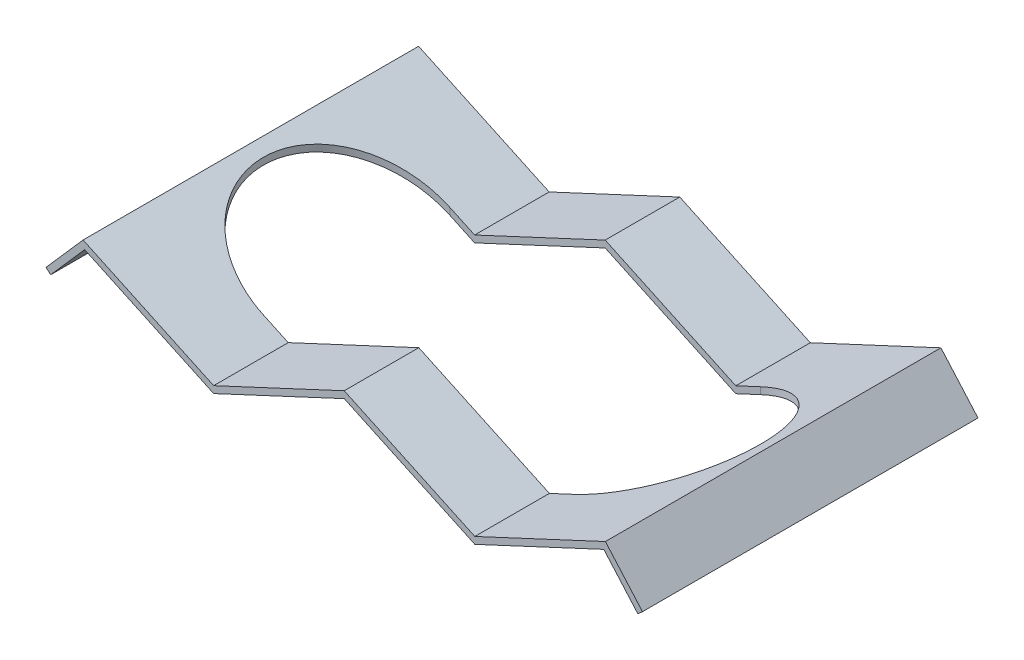
ISO-10303-21;
HEADER;
FILE_DESCRIPTION(('STEP AP214'),'2;1');
FILE_NAME('part.step','',(''),(''),'','','');
FILE_SCHEMA(('AUTOMOTIVE_DESIGN { 1 0 10303 214 1 1 1 1 }'));
ENDSEC;
DATA;
#1=APPLICATION_CONTEXT('core data for automotive mechanical design processes');
#2=APPLICATION_PROTOCOL_DEFINITION('international standard','automotive_design',2000,#1);
#3=PRODUCT_CONTEXT('',#1,'mechanical');
#4=PRODUCT('Part','Part','',(#3));
#5=PRODUCT_RELATED_PRODUCT_CATEGORY('part','',(#4));
#6=PRODUCT_DEFINITION_FORMATION('','',#4);
#7=PRODUCT_DEFINITION_CONTEXT('part definition',#1,'design');
#8=PRODUCT_DEFINITION('design','',#6,#7);
#9=PRODUCT_DEFINITION_SHAPE('','',#8);
#10=(LENGTH_UNIT() NAMED_UNIT(*) SI_UNIT(.MILLI.,.METRE.));
#11=(NAMED_UNIT(*) PLANE_ANGLE_UNIT() SI_UNIT($,.RADIAN.));
#12=(NAMED_UNIT(*) SI_UNIT($,.STERADIAN.) SOLID_ANGLE_UNIT());
#13=UNCERTAINTY_MEASURE_WITH_UNIT(LENGTH_MEASURE(1.E-05),#10,'distance_accuracy_value','');
#14=(GEOMETRIC_REPRESENTATION_CONTEXT(3) GLOBAL_UNCERTAINTY_ASSIGNED_CONTEXT((#13)) GLOBAL_UNIT_ASSIGNED_CONTEXT((#10,
#11,#12)) REPRESENTATION_CONTEXT('',''));
#15=CARTESIAN_POINT('',(0.,0.,0.));
#16=DIRECTION('',(0.,0.,1.));
#17=DIRECTION('',(1.,0.,0.));
#18=AXIS2_PLACEMENT_3D('',#15,#16,#17);
#19=CARTESIAN_POINT('',(0.,2.45,13.5));
#20=DIRECTION('',(0.422618261740701,0.906307787036649,0.));
#21=DIRECTION('',(-0.906307787036649,0.422618261740701,0.));
#22=AXIS2_PLACEMENT_3D('',#19,#20,#21);
#23=PLANE('',#22);
#24=DIRECTION('',(-0.906307787036649,0.422618261740701,0.));
#25=VECTOR('',#24,1.);
#26=CARTESIAN_POINT('',(0.,2.45,-7.5));
#27=LINE('',#26,#25);
#28=CARTESIAN_POINT('',(10.5080839104968,-2.45,-7.5));
#29=VERTEX_POINT('',#28);
#30=CARTESIAN_POINT('',(0.,2.45000000000001,-7.5));
#31=VERTEX_POINT('',#30);
#32=EDGE_CURVE('E411',#29,#31,#27,.T.);
#33=ORIENTED_EDGE('',*,*,#32,.F.);
#34=DIRECTION('',(0.,0.,-1.));
#35=VECTOR('',#34,1.);
#36=CARTESIAN_POINT('',(10.5080839104968,-2.45,13.5));
#37=LINE('',#36,#35);
#38=CARTESIAN_POINT('',(10.5080839104968,-2.45,-13.5));
#39=VERTEX_POINT('',#38);
#40=EDGE_CURVE('E273',#29,#39,#37,.T.);
#41=ORIENTED_EDGE('',*,*,#40,.T.);
#42=DIRECTION('',(0.906307787036649,-0.422618261740701,0.));
#43=VECTOR('',#42,1.);
#44=CARTESIAN_POINT('',(0.,2.45,-13.5));
#45=LINE('',#44,#43);
#46=CARTESIAN_POINT('',(0.,2.45,-13.5));
#47=VERTEX_POINT('',#46);
#48=EDGE_CURVE('E337',#47,#39,#45,.T.);
#49=ORIENTED_EDGE('',*,*,#48,.F.);
#50=DIRECTION('',(0.,0.,-1.));
#51=VECTOR('',#50,1.);
#52=CARTESIAN_POINT('',(0.,2.45,13.5));
#53=LINE('',#52,#51);
#54=EDGE_CURVE('E268',#31,#47,#53,.T.);
#55=ORIENTED_EDGE('',*,*,#54,.F.);
#56=EDGE_LOOP('',(#33,#41,#49,#55));
#57=FACE_BOUND('',#56,.T.);
#58=ADVANCED_FACE('F43',(#57),#23,.T.);
#59=CARTESIAN_POINT('',(-10.5080839104968,-2.45,13.5));
#60=DIRECTION('',(-0.422618261740701,0.906307787036649,0.));
#61=DIRECTION('',(-0.906307787036649,-0.422618261740701,0.));
#62=AXIS2_PLACEMENT_3D('',#59,#60,#61);
#63=PLANE('',#62);
#64=DIRECTION('',(-0.906307787036649,-0.422618261740701,0.));
#65=VECTOR('',#64,1.);
#66=CARTESIAN_POINT('',(-10.5080839104968,-2.45,-7.5));
#67=LINE('',#66,#65);
#68=CARTESIAN_POINT('',(-10.5080839104968,-2.45,-7.5));
#69=VERTEX_POINT('',#68);
#70=EDGE_CURVE('E414',#31,#69,#67,.T.);
#71=ORIENTED_EDGE('',*,*,#70,.F.);
#72=ORIENTED_EDGE('',*,*,#54,.T.);
#73=DIRECTION('',(0.906307787036649,0.422618261740701,0.));
#74=VECTOR('',#73,1.);
#75=CARTESIAN_POINT('',(-10.5080839104968,-2.45,-13.5));
#76=LINE('',#75,#74);
#77=CARTESIAN_POINT('',(-10.5080839104968,-2.45,-13.5));
#78=VERTEX_POINT('',#77);
#79=EDGE_CURVE('E333',#78,#47,#76,.T.);
#80=ORIENTED_EDGE('',*,*,#79,.F.);
#81=DIRECTION('',(0.,0.,-1.));
#82=VECTOR('',#81,1.);
#83=CARTESIAN_POINT('',(-10.5080839104968,-2.45,13.5));
#84=LINE('',#83,#82);
#85=EDGE_CURVE('E263',#69,#78,#84,.T.);
#86=ORIENTED_EDGE('',*,*,#85,.F.);
#87=EDGE_LOOP('',(#71,#72,#80,#86));
#88=FACE_BOUND('',#87,.T.);
#89=ADVANCED_FACE('F524',(#88),#63,.T.);
#90=CARTESIAN_POINT('',(-10.2967747796265,-2.90315389351832,13.5));
#91=DIRECTION('',(-0.422618261740701,0.906307787036649,0.));
#92=DIRECTION('',(-0.906307787036649,-0.422618261740701,0.));
#93=AXIS2_PLACEMENT_3D('',#90,#91,#92);
#94=PLANE('',#93);
#95=DIRECTION('',(0.,0.,-1.));
#96=VECTOR('',#95,1.);
#97=CARTESIAN_POINT('',(0.,1.89831104051876,13.5));
#98=LINE('',#97,#96);
#99=CARTESIAN_POINT('',(0.,1.89831104051876,-7.5));
#100=VERTEX_POINT('',#99);
#101=CARTESIAN_POINT('',(0.,1.89831104051876,-13.5));
#102=VERTEX_POINT('',#101);
#103=EDGE_CURVE('E235',#100,#102,#98,.T.);
#104=ORIENTED_EDGE('',*,*,#103,.F.);
#105=DIRECTION('',(-0.906307787036649,-0.422618261740701,0.));
#106=VECTOR('',#105,1.);
#107=CARTESIAN_POINT('',(-10.2967747796265,-2.90315389351832,-7.5));
#108=LINE('',#107,#106);
#109=CARTESIAN_POINT('',(-10.5080839104968,-3.00168895948125,-7.5));
#110=VERTEX_POINT('',#109);
#111=EDGE_CURVE('E209',#100,#110,#108,.T.);
#112=ORIENTED_EDGE('',*,*,#111,.T.);
#113=DIRECTION('',(0.,0.,-1.));
#114=VECTOR('',#113,1.);
#115=CARTESIAN_POINT('',(-10.5080839104968,-3.00168895948124,13.5));
#116=LINE('',#115,#114);
#117=CARTESIAN_POINT('',(-10.5080839104968,-3.00168895948124,-13.5));
#118=VERTEX_POINT('',#117);
#119=EDGE_CURVE('E245',#110,#118,#116,.T.);
#120=ORIENTED_EDGE('',*,*,#119,.T.);
#121=DIRECTION('',(0.906307787036649,0.422618261740701,0.));
#122=VECTOR('',#121,1.);
#123=CARTESIAN_POINT('',(-10.2967747796265,-2.90315389351832,-13.5));
#124=LINE('',#123,#122);
#125=EDGE_CURVE('E299',#118,#102,#124,.T.);
#126=ORIENTED_EDGE('',*,*,#125,.T.);
#127=EDGE_LOOP('',(#104,#112,#120,#126));
#128=FACE_BOUND('',#127,.T.);
#129=ADVANCED_FACE('F300',(#128),#94,.F.);
#130=CARTESIAN_POINT('',(-0.211309130870354,1.99684610648168,13.5));
#131=DIRECTION('',(0.422618261740701,0.906307787036649,0.));
#132=DIRECTION('',(-0.906307787036649,0.422618261740701,0.));
#133=AXIS2_PLACEMENT_3D('',#130,#131,#132);
#134=PLANE('',#133);
#135=DIRECTION('',(0.,0.,-1.));
#136=VECTOR('',#135,1.);
#137=CARTESIAN_POINT('',(10.5080839104968,-3.00168895948125,13.5));
#138=LINE('',#137,#136);
#139=CARTESIAN_POINT('',(10.5080839104968,-3.00168895948125,-7.5));
#140=VERTEX_POINT('',#139);
#141=CARTESIAN_POINT('',(10.5080839104968,-3.00168895948125,-13.5));
#142=VERTEX_POINT('',#141);
#143=EDGE_CURVE('E219',#140,#142,#138,.T.);
#144=ORIENTED_EDGE('',*,*,#143,.F.);
#145=DIRECTION('',(-0.906307787036649,0.422618261740701,0.));
#146=VECTOR('',#145,1.);
#147=CARTESIAN_POINT('',(-0.211309130870354,1.99684610648168,-7.5));
#148=LINE('',#147,#146);
#149=EDGE_CURVE('E203',#140,#100,#148,.T.);
#150=ORIENTED_EDGE('',*,*,#149,.T.);
#151=ORIENTED_EDGE('',*,*,#103,.T.);
#152=DIRECTION('',(0.906307787036649,-0.422618261740701,0.));
#153=VECTOR('',#152,1.);
#154=CARTESIAN_POINT('',(-0.211309130870354,1.99684610648168,-13.5));
#155=LINE('',#154,#153);
#156=EDGE_CURVE('E226',#102,#142,#155,.T.);
#157=ORIENTED_EDGE('',*,*,#156,.T.);
#158=EDGE_LOOP('',(#144,#150,#151,#157));
#159=FACE_BOUND('',#158,.T.);
#160=ADVANCED_FACE('F224',(#159),#134,.F.);
#161=CARTESIAN_POINT('',(20.6403636734295,2.12019514455722,13.5));
#162=DIRECTION('',(0.751608295128168,0.659609710885558,0.));
#163=DIRECTION('',(-0.659609710885558,0.751608295128168,0.));
#164=AXIS2_PLACEMENT_3D('',#161,#162,#163);
#165=PLANE('',#164);
#166=DIRECTION('',(0.659609710885558,-0.751608295128168,0.));
#167=VECTOR('',#166,1.);
#168=CARTESIAN_POINT('',(20.6403636734295,2.12019514455722,-13.5));
#169=LINE('',#168,#167);
#170=CARTESIAN_POINT('',(20.8876727560338,1.83839280769289,-13.5));
#171=VERTEX_POINT('',#170);
#172=CARTESIAN_POINT('',(23.624195852435,-1.27980485544275,-13.5));
#173=VERTEX_POINT('',#172);
#174=EDGE_CURVE('E353',#171,#173,#169,.T.);
#175=ORIENTED_EDGE('',*,*,#174,.T.);
#176=DIRECTION('',(0.,0.,-1.));
#177=VECTOR('',#176,1.);
#178=CARTESIAN_POINT('',(23.624195852435,-1.27980485544275,13.5));
#179=LINE('',#178,#177);
#180=CARTESIAN_POINT('',(23.624195852435,-1.27980485544275,13.5));
#181=VERTEX_POINT('',#180);
#182=EDGE_CURVE('E284',#181,#173,#179,.T.);
#183=ORIENTED_EDGE('',*,*,#182,.F.);
#184=DIRECTION('',(0.659609710885558,-0.751608295128168,0.));
#185=VECTOR('',#184,1.);
#186=CARTESIAN_POINT('',(20.6403636734295,2.12019514455722,13.5));
#187=LINE('',#186,#185);
#188=CARTESIAN_POINT('',(20.8876727560338,1.83839280769289,13.5));
#189=VERTEX_POINT('',#188);
#190=EDGE_CURVE('E314',#189,#181,#187,.T.);
#191=ORIENTED_EDGE('',*,*,#190,.F.);
#192=DIRECTION('',(0.,0.,-1.));
#193=VECTOR('',#192,1.);
#194=CARTESIAN_POINT('',(20.8876727560338,1.83839280769289,13.5));
#195=LINE('',#194,#193);
#196=EDGE_CURVE('E230',#189,#171,#195,.T.);
#197=ORIENTED_EDGE('',*,*,#196,.T.);
#198=EDGE_LOOP('',(#175,#183,#191,#197));
#199=FACE_BOUND('',#198,.T.);
#200=ADVANCED_FACE('F45',(#199),#165,.F.);
#201=CARTESIAN_POINT('',(23.9999999999991,-0.949999999999971,13.5));
#202=DIRECTION('',(0.659609710885559,-0.751608295128167,0.));
#203=DIRECTION('',(0.751608295128167,0.659609710885559,0.));
#204=AXIS2_PLACEMENT_3D('',#201,#202,#203);
#205=PLANE('',#204);
#206=DIRECTION('',(-0.751608295128167,-0.659609710885559,0.));
#207=VECTOR('',#206,1.);
#208=CARTESIAN_POINT('',(23.9999999999991,-0.949999999999971,-13.5));
#209=LINE('',#208,#207);
#210=CARTESIAN_POINT('',(23.9999999999991,-0.949999999999971,-13.5));
#211=VERTEX_POINT('',#210);
#212=EDGE_CURVE('E349',#211,#173,#209,.T.);
#213=ORIENTED_EDGE('',*,*,#212,.F.);
#214=DIRECTION('',(0.,0.,-1.));
#215=VECTOR('',#214,1.);
#216=CARTESIAN_POINT('',(23.9999999999991,-0.949999999999971,13.5));
#217=LINE('',#216,#215);
#218=CARTESIAN_POINT('',(23.9999999999991,-0.949999999999971,13.5));
#219=VERTEX_POINT('',#218);
#220=EDGE_CURVE('E281',#219,#211,#217,.T.);
#221=ORIENTED_EDGE('',*,*,#220,.F.);
#222=DIRECTION('',(-0.751608295128167,-0.659609710885559,0.));
#223=VECTOR('',#222,1.);
#224=CARTESIAN_POINT('',(23.9999999999991,-0.949999999999971,13.5));
#225=LINE('',#224,#223);
#226=EDGE_CURVE('E400',#219,#181,#225,.T.);
#227=ORIENTED_EDGE('',*,*,#226,.T.);
#228=ORIENTED_EDGE('',*,*,#182,.T.);
#229=EDGE_LOOP('',(#213,#221,#227,#228));
#230=FACE_BOUND('',#229,.T.);
#231=ADVANCED_FACE('F534',(#230),#205,.T.);
#232=CARTESIAN_POINT('',(21.0161678209936,2.45,13.5));
#233=DIRECTION('',(0.751608295128168,0.659609710885558,0.));
#234=DIRECTION('',(-0.659609710885558,0.751608295128168,0.));
#235=AXIS2_PLACEMENT_3D('',#232,#233,#234);
#236=PLANE('',#235);
#237=DIRECTION('',(0.659609710885558,-0.751608295128168,0.));
#238=VECTOR('',#237,1.);
#239=CARTESIAN_POINT('',(21.0161678209936,2.45,-13.5));
#240=LINE('',#239,#238);
#241=CARTESIAN_POINT('',(21.0161678209936,2.45,-13.5));
#242=VERTEX_POINT('',#241);
#243=EDGE_CURVE('E345',#242,#211,#240,.T.);
#244=ORIENTED_EDGE('',*,*,#243,.F.);
#245=DIRECTION('',(0.,0.,-1.));
#246=VECTOR('',#245,1.);
#247=CARTESIAN_POINT('',(21.0161678209936,2.45,13.5));
#248=LINE('',#247,#246);
#249=CARTESIAN_POINT('',(21.0161678209936,2.45,13.5));
#250=VERTEX_POINT('',#249);
#251=EDGE_CURVE('E278',#250,#242,#248,.T.);
#252=ORIENTED_EDGE('',*,*,#251,.F.);
#253=DIRECTION('',(0.659609710885558,-0.751608295128168,0.));
#254=VECTOR('',#253,1.);
#255=CARTESIAN_POINT('',(21.0161678209936,2.45,13.5));
#256=LINE('',#255,#254);
#257=EDGE_CURVE('E396',#250,#219,#256,.T.);
#258=ORIENTED_EDGE('',*,*,#257,.T.);
#259=ORIENTED_EDGE('',*,*,#220,.T.);
#260=EDGE_LOOP('',(#244,#252,#258,#259));
#261=FACE_BOUND('',#260,.T.);
#262=ADVANCED_FACE('F532',(#261),#236,.T.);
#263=CARTESIAN_POINT('',(10.5080839104968,-2.45,13.5));
#264=DIRECTION('',(-0.4226182617407,0.906307787036649,0.));
#265=DIRECTION('',(-0.906307787036649,-0.4226182617407,0.));
#266=AXIS2_PLACEMENT_3D('',#263,#264,#265);
#267=PLANE('',#266);
#268=DIRECTION('',(-0.906307787036649,-0.4226182617407,0.));
#269=VECTOR('',#268,1.);
#270=CARTESIAN_POINT('',(10.5080839104968,-2.45,-7.5));
#271=LINE('',#270,#269);
#272=CARTESIAN_POINT('',(12.5,-1.52115427306249,-7.5));
#273=VERTEX_POINT('',#272);
#274=EDGE_CURVE('E408',#273,#29,#271,.T.);
#275=ORIENTED_EDGE('',*,*,#274,.F.);
#276=CARTESIAN_POINT('',(12.5,-1.52115427306249,0.));
#277=DIRECTION('',(-0.4226182617407,0.906307787036649,0.));
#278=DIRECTION('',(0.906307787036649,0.4226182617407,0.));
#279=AXIS2_PLACEMENT_3D('',#276,#277,#278);
#280=ELLIPSE('',#279,8.27533439221869,7.5);
#281=CARTESIAN_POINT('',(12.5,-1.52115427306249,7.5));
#282=VERTEX_POINT('',#281);
#283=EDGE_CURVE('E214',#282,#273,#280,.T.);
#284=ORIENTED_EDGE('',*,*,#283,.F.);
#285=DIRECTION('',(0.906307787036649,0.4226182617407,0.));
#286=VECTOR('',#285,1.);
#287=CARTESIAN_POINT('',(10.5080839104968,-2.45,7.5));
#288=LINE('',#287,#286);
#289=CARTESIAN_POINT('',(10.5080839104968,-2.45,7.5));
#290=VERTEX_POINT('',#289);
#291=EDGE_CURVE('E428',#290,#282,#288,.T.);
#292=ORIENTED_EDGE('',*,*,#291,.F.);
#293=CARTESIAN_POINT('',(10.5080839104968,-2.45,13.5));
#294=VERTEX_POINT('',#293);
#295=EDGE_CURVE('E274',#294,#290,#37,.T.);
#296=ORIENTED_EDGE('',*,*,#295,.F.);
#297=DIRECTION('',(0.906307787036649,0.4226182617407,0.));
#298=VECTOR('',#297,1.);
#299=CARTESIAN_POINT('',(10.5080839104968,-2.45,13.5));
#300=LINE('',#299,#298);
#301=EDGE_CURVE('E392',#294,#250,#300,.T.);
#302=ORIENTED_EDGE('',*,*,#301,.T.);
#303=ORIENTED_EDGE('',*,*,#251,.T.);
#304=DIRECTION('',(0.906307787036649,0.4226182617407,0.));
#305=VECTOR('',#304,1.);
#306=CARTESIAN_POINT('',(10.5080839104968,-2.45,-13.5));
#307=LINE('',#306,#305);
#308=EDGE_CURVE('E341',#39,#242,#307,.T.);
#309=ORIENTED_EDGE('',*,*,#308,.F.);
#310=ORIENTED_EDGE('',*,*,#40,.F.);
#311=EDGE_LOOP('',(#275,#284,#292,#296,#302,#303,#309,#310));
#312=FACE_BOUND('',#311,.T.);
#313=ADVANCED_FACE('F488',(#312),#267,.T.);
#314=DIRECTION('',(0.906307787036649,-0.422618261740701,0.));
#315=VECTOR('',#314,1.);
#316=CARTESIAN_POINT('',(0.,2.45,7.5));
#317=LINE('',#316,#315);
#318=CARTESIAN_POINT('',(0.,2.45000000000001,7.5));
#319=VERTEX_POINT('',#318);
#320=EDGE_CURVE('E431',#319,#290,#317,.T.);
#321=ORIENTED_EDGE('',*,*,#320,.F.);
#322=CARTESIAN_POINT('',(0.,2.45,13.5));
#323=VERTEX_POINT('',#322);
#324=EDGE_CURVE('E269',#323,#319,#53,.T.);
#325=ORIENTED_EDGE('',*,*,#324,.F.);
#326=DIRECTION('',(0.906307787036649,-0.422618261740701,0.));
#327=VECTOR('',#326,1.);
#328=CARTESIAN_POINT('',(0.,2.45,13.5));
#329=LINE('',#328,#327);
#330=EDGE_CURVE('E388',#323,#294,#329,.T.);
#331=ORIENTED_EDGE('',*,*,#330,.T.);
#332=ORIENTED_EDGE('',*,*,#295,.T.);
#333=EDGE_LOOP('',(#321,#325,#331,#332));
#334=FACE_BOUND('',#333,.T.);
#335=ADVANCED_FACE('F479',(#334),#23,.T.);
#336=DIRECTION('',(0.906307787036649,0.422618261740701,0.));
#337=VECTOR('',#336,1.);
#338=CARTESIAN_POINT('',(-10.5080839104968,-2.45,7.5));
#339=LINE('',#338,#337);
#340=CARTESIAN_POINT('',(-10.5080839104968,-2.45,7.5));
#341=VERTEX_POINT('',#340);
#342=EDGE_CURVE('E434',#341,#319,#339,.T.);
#343=ORIENTED_EDGE('',*,*,#342,.F.);
#344=CARTESIAN_POINT('',(-10.5080839104968,-2.45,13.5));
#345=VERTEX_POINT('',#344);
#346=EDGE_CURVE('E264',#345,#341,#84,.T.);
#347=ORIENTED_EDGE('',*,*,#346,.F.);
#348=DIRECTION('',(0.906307787036649,0.422618261740701,0.));
#349=VECTOR('',#348,1.);
#350=CARTESIAN_POINT('',(-10.5080839104968,-2.45,13.5));
#351=LINE('',#350,#349);
#352=EDGE_CURVE('E384',#345,#323,#351,.T.);
#353=ORIENTED_EDGE('',*,*,#352,.T.);
#354=ORIENTED_EDGE('',*,*,#324,.T.);
#355=EDGE_LOOP('',(#343,#347,#353,#354));
#356=FACE_BOUND('',#355,.T.);
#357=ADVANCED_FACE('F475',(#356),#63,.T.);
#358=CARTESIAN_POINT('',(-21.0161678209936,2.45000000000001,13.5));
#359=DIRECTION('',(0.4226182617407,0.906307787036649,0.));
#360=DIRECTION('',(-0.906307787036649,0.4226182617407,0.));
#361=AXIS2_PLACEMENT_3D('',#358,#359,#360);
#362=PLANE('',#361);
#363=DIRECTION('',(-0.906307787036649,0.4226182617407,0.));
#364=VECTOR('',#363,1.);
#365=CARTESIAN_POINT('',(-21.0161678209936,2.45000000000001,-7.5));
#366=LINE('',#365,#364);
#367=CARTESIAN_POINT('',(-12.5,-1.5211542730625,-7.5));
#368=VERTEX_POINT('',#367);
#369=EDGE_CURVE('E417',#69,#368,#366,.T.);
#370=ORIENTED_EDGE('',*,*,#369,.F.);
#371=ORIENTED_EDGE('',*,*,#85,.T.);
#372=DIRECTION('',(0.906307787036649,-0.4226182617407,0.));
#373=VECTOR('',#372,1.);
#374=CARTESIAN_POINT('',(-21.0161678209936,2.45000000000001,-13.5));
#375=LINE('',#374,#373);
#376=CARTESIAN_POINT('',(-21.0161678209936,2.45000000000001,-13.5));
#377=VERTEX_POINT('',#376);
#378=EDGE_CURVE('E329',#377,#78,#375,.T.);
#379=ORIENTED_EDGE('',*,*,#378,.F.);
#380=DIRECTION('',(0.,0.,-1.));
#381=VECTOR('',#380,1.);
#382=CARTESIAN_POINT('',(-21.0161678209936,2.45000000000001,13.5));
#383=LINE('',#382,#381);
#384=CARTESIAN_POINT('',(-21.0161678209936,2.45000000000001,13.5));
#385=VERTEX_POINT('',#384);
#386=EDGE_CURVE('E260',#385,#377,#383,.T.);
#387=ORIENTED_EDGE('',*,*,#386,.F.);
#388=DIRECTION('',(0.906307787036649,-0.4226182617407,0.));
#389=VECTOR('',#388,1.);
#390=CARTESIAN_POINT('',(-21.0161678209936,2.45000000000001,13.5));
#391=LINE('',#390,#389);
#392=EDGE_CURVE('E380',#385,#345,#391,.T.);
#393=ORIENTED_EDGE('',*,*,#392,.T.);
#394=ORIENTED_EDGE('',*,*,#346,.T.);
#395=DIRECTION('',(0.906307787036649,-0.4226182617407,0.));
#396=VECTOR('',#395,1.);
#397=CARTESIAN_POINT('',(-21.0161678209936,2.45000000000001,7.5));
#398=LINE('',#397,#396);
#399=CARTESIAN_POINT('',(-12.5,-1.5211542730625,7.5));
#400=VERTEX_POINT('',#399);
#401=EDGE_CURVE('E437',#400,#341,#398,.T.);
#402=ORIENTED_EDGE('',*,*,#401,.F.);
#403=CARTESIAN_POINT('',(-12.5,-1.5211542730625,0.));
#404=DIRECTION('',(0.4226182617407,0.906307787036649,0.));
#405=DIRECTION('',(-0.90630778703665,0.4226182617407,0.));
#406=AXIS2_PLACEMENT_3D('',#403,#404,#405);
#407=ELLIPSE('',#406,8.27533439221869,7.5);
#408=EDGE_CURVE('E357',#368,#400,#407,.T.);
#409=ORIENTED_EDGE('',*,*,#408,.F.);
#410=EDGE_LOOP('',(#370,#371,#379,#387,#393,#394,#402,#409));
#411=FACE_BOUND('',#410,.T.);
#412=ADVANCED_FACE('F469',(#411),#362,.T.);
#413=CARTESIAN_POINT('',(-23.9999999999991,-0.949999999999917,13.5));
#414=DIRECTION('',(-0.751608295128168,0.659609710885558,0.));
#415=DIRECTION('',(-0.659609710885558,-0.751608295128168,0.));
#416=AXIS2_PLACEMENT_3D('',#413,#414,#415);
#417=PLANE('',#416);
#418=DIRECTION('',(0.659609710885558,0.751608295128167,0.));
#419=VECTOR('',#418,1.);
#420=CARTESIAN_POINT('',(-23.9999999999991,-0.949999999999917,-13.5));
#421=LINE('',#420,#419);
#422=CARTESIAN_POINT('',(-23.9999999999991,-0.949999999999917,-13.5));
#423=VERTEX_POINT('',#422);
#424=EDGE_CURVE('E325',#423,#377,#421,.T.);
#425=ORIENTED_EDGE('',*,*,#424,.F.);
#426=DIRECTION('',(0.,0.,-1.));
#427=VECTOR('',#426,1.);
#428=CARTESIAN_POINT('',(-23.9999999999991,-0.949999999999917,13.5));
#429=LINE('',#428,#427);
#430=CARTESIAN_POINT('',(-23.9999999999991,-0.949999999999917,13.5));
#431=VERTEX_POINT('',#430);
#432=EDGE_CURVE('E257',#431,#423,#429,.T.);
#433=ORIENTED_EDGE('',*,*,#432,.F.);
#434=DIRECTION('',(0.659609710885558,0.751608295128167,0.));
#435=VECTOR('',#434,1.);
#436=CARTESIAN_POINT('',(-23.9999999999991,-0.949999999999917,13.5));
#437=LINE('',#436,#435);
#438=EDGE_CURVE('E376',#431,#385,#437,.T.);
#439=ORIENTED_EDGE('',*,*,#438,.T.);
#440=ORIENTED_EDGE('',*,*,#386,.T.);
#441=EDGE_LOOP('',(#425,#433,#439,#440));
#442=FACE_BOUND('',#441,.T.);
#443=ADVANCED_FACE('F519',(#442),#417,.T.);
#444=CARTESIAN_POINT('',(-23.624195852435,-1.2798048554427,13.5));
#445=DIRECTION('',(-0.659609710885559,-0.751608295128167,0.));
#446=DIRECTION('',(0.751608295128167,-0.659609710885559,0.));
#447=AXIS2_PLACEMENT_3D('',#444,#445,#446);
#448=PLANE('',#447);
#449=DIRECTION('',(-0.751608295128167,0.659609710885559,0.));
#450=VECTOR('',#449,1.);
#451=CARTESIAN_POINT('',(-23.624195852435,-1.2798048554427,-13.5));
#452=LINE('',#451,#450);
#453=CARTESIAN_POINT('',(-23.624195852435,-1.2798048554427,-13.5));
#454=VERTEX_POINT('',#453);
#455=EDGE_CURVE('E321',#454,#423,#452,.T.);
#456=ORIENTED_EDGE('',*,*,#455,.F.);
#457=DIRECTION('',(0.,0.,-1.));
#458=VECTOR('',#457,1.);
#459=CARTESIAN_POINT('',(-23.624195852435,-1.2798048554427,13.5));
#460=LINE('',#459,#458);
#461=CARTESIAN_POINT('',(-23.624195852435,-1.2798048554427,13.5));
#462=VERTEX_POINT('',#461);
#463=EDGE_CURVE('E254',#462,#454,#460,.T.);
#464=ORIENTED_EDGE('',*,*,#463,.F.);
#465=DIRECTION('',(-0.751608295128167,0.659609710885559,0.));
#466=VECTOR('',#465,1.);
#467=CARTESIAN_POINT('',(-23.624195852435,-1.2798048554427,13.5));
#468=LINE('',#467,#466);
#469=EDGE_CURVE('E372',#462,#431,#468,.T.);
#470=ORIENTED_EDGE('',*,*,#469,.T.);
#471=ORIENTED_EDGE('',*,*,#432,.T.);
#472=EDGE_LOOP('',(#456,#464,#470,#471));
#473=FACE_BOUND('',#472,.T.);
#474=ADVANCED_FACE('F513',(#473),#448,.T.);
#475=CARTESIAN_POINT('',(-23.624195852435,-1.2798048554427,13.5));
#476=DIRECTION('',(-0.751608295128168,0.659609710885558,0.));
#477=DIRECTION('',(-0.659609710885558,-0.751608295128168,0.));
#478=AXIS2_PLACEMENT_3D('',#475,#476,#477);
#479=PLANE('',#478);
#480=DIRECTION('',(0.659609710885558,0.751608295128167,0.));
#481=VECTOR('',#480,1.);
#482=CARTESIAN_POINT('',(-23.624195852435,-1.2798048554427,-13.5));
#483=LINE('',#482,#481);
#484=CARTESIAN_POINT('',(-20.8876727560339,1.8383928076929,-13.5));
#485=VERTEX_POINT('',#484);
#486=EDGE_CURVE('E318',#454,#485,#483,.T.);
#487=ORIENTED_EDGE('',*,*,#486,.T.);
#488=DIRECTION('',(0.,0.,-1.));
#489=VECTOR('',#488,1.);
#490=CARTESIAN_POINT('',(-20.8876727560339,1.8383928076929,13.5));
#491=LINE('',#490,#489);
#492=CARTESIAN_POINT('',(-20.8876727560339,1.8383928076929,13.5));
#493=VERTEX_POINT('',#492);
#494=EDGE_CURVE('E250',#493,#485,#491,.T.);
#495=ORIENTED_EDGE('',*,*,#494,.F.);
#496=DIRECTION('',(0.659609710885558,0.751608295128167,0.));
#497=VECTOR('',#496,1.);
#498=CARTESIAN_POINT('',(-23.624195852435,-1.2798048554427,13.5));
#499=LINE('',#498,#497);
#500=EDGE_CURVE('E369',#462,#493,#499,.T.);
#501=ORIENTED_EDGE('',*,*,#500,.F.);
#502=ORIENTED_EDGE('',*,*,#463,.T.);
#503=EDGE_LOOP('',(#487,#495,#501,#502));
#504=FACE_BOUND('',#503,.T.);
#505=ADVANCED_FACE('F539',(#504),#479,.F.);
#506=CARTESIAN_POINT('',(-21.227476951864,1.99684610648168,13.5));
#507=DIRECTION('',(0.4226182617407,0.906307787036649,0.));
#508=DIRECTION('',(-0.906307787036649,0.4226182617407,0.));
#509=AXIS2_PLACEMENT_3D('',#506,#507,#508);
#510=PLANE('',#509);
#511=ORIENTED_EDGE('',*,*,#119,.F.);
#512=DIRECTION('',(-0.906307787036649,0.4226182617407,0.));
#513=VECTOR('',#512,1.);
#514=CARTESIAN_POINT('',(-21.227476951864,1.99684610648168,-7.5));
#515=LINE('',#514,#513);
#516=CARTESIAN_POINT('',(-12.5,-2.07284323254374,-7.5));
#517=VERTEX_POINT('',#516);
#518=EDGE_CURVE('E420',#110,#517,#515,.T.);
#519=ORIENTED_EDGE('',*,*,#518,.T.);
#520=CARTESIAN_POINT('',(-12.5,-2.07284323254374,0.));
#521=DIRECTION('',(0.4226182617407,0.906307787036649,0.));
#522=DIRECTION('',(-0.90630778703665,0.4226182617407,0.));
#523=AXIS2_PLACEMENT_3D('',#520,#521,#522);
#524=ELLIPSE('',#523,8.27533439221869,7.5);
#525=CARTESIAN_POINT('',(-12.5,-2.07284323254374,7.5));
#526=VERTEX_POINT('',#525);
#527=EDGE_CURVE('E11',#517,#526,#524,.T.);
#528=ORIENTED_EDGE('',*,*,#527,.T.);
#529=DIRECTION('',(0.906307787036649,-0.4226182617407,0.));
#530=VECTOR('',#529,1.);
#531=CARTESIAN_POINT('',(-21.227476951864,1.99684610648168,7.5));
#532=LINE('',#531,#530);
#533=CARTESIAN_POINT('',(-10.5080839104968,-3.00168895948125,7.5));
#534=VERTEX_POINT('',#533);
#535=EDGE_CURVE('E440',#526,#534,#532,.T.);
#536=ORIENTED_EDGE('',*,*,#535,.T.);
#537=CARTESIAN_POINT('',(-10.5080839104968,-3.00168895948124,13.5));
#538=VERTEX_POINT('',#537);
#539=EDGE_CURVE('E246',#538,#534,#116,.T.);
#540=ORIENTED_EDGE('',*,*,#539,.F.);
#541=DIRECTION('',(0.906307787036649,-0.4226182617407,0.));
#542=VECTOR('',#541,1.);
#543=CARTESIAN_POINT('',(-21.227476951864,1.99684610648168,13.5));
#544=LINE('',#543,#542);
#545=EDGE_CURVE('E366',#493,#538,#544,.T.);
#546=ORIENTED_EDGE('',*,*,#545,.F.);
#547=ORIENTED_EDGE('',*,*,#494,.T.);
#548=DIRECTION('',(0.906307787036649,-0.4226182617407,0.));
#549=VECTOR('',#548,1.);
#550=CARTESIAN_POINT('',(-21.227476951864,1.99684610648168,-13.5));
#551=LINE('',#550,#549);
#552=EDGE_CURVE('E306',#485,#118,#551,.T.);
#553=ORIENTED_EDGE('',*,*,#552,.T.);
#554=EDGE_LOOP('',(#511,#519,#528,#536,#540,#546,#547,#553));
#555=FACE_BOUND('',#554,.T.);
#556=ADVANCED_FACE('F506',(#555),#510,.F.);
#557=ORIENTED_EDGE('',*,*,#539,.T.);
#558=DIRECTION('',(0.906307787036649,0.422618261740701,0.));
#559=VECTOR('',#558,1.);
#560=CARTESIAN_POINT('',(-10.2967747796265,-2.90315389351832,7.5));
#561=LINE('',#560,#559);
#562=CARTESIAN_POINT('',(0.,1.89831104051876,7.5));
#563=VERTEX_POINT('',#562);
#564=EDGE_CURVE('E444',#534,#563,#561,.T.);
#565=ORIENTED_EDGE('',*,*,#564,.T.);
#566=CARTESIAN_POINT('',(0.,1.89831104051876,13.5));
#567=VERTEX_POINT('',#566);
#568=EDGE_CURVE('E241',#567,#563,#98,.T.);
#569=ORIENTED_EDGE('',*,*,#568,.F.);
#570=DIRECTION('',(0.906307787036649,0.422618261740701,0.));
#571=VECTOR('',#570,1.);
#572=CARTESIAN_POINT('',(-10.2967747796265,-2.90315389351832,13.5));
#573=LINE('',#572,#571);
#574=EDGE_CURVE('E363',#538,#567,#573,.T.);
#575=ORIENTED_EDGE('',*,*,#574,.F.);
#576=EDGE_LOOP('',(#557,#565,#569,#575));
#577=FACE_BOUND('',#576,.T.);
#578=ADVANCED_FACE('F503',(#577),#94,.F.);
#579=ORIENTED_EDGE('',*,*,#568,.T.);
#580=DIRECTION('',(0.906307787036649,-0.422618261740701,0.));
#581=VECTOR('',#580,1.);
#582=CARTESIAN_POINT('',(-0.211309130870354,1.99684610648168,7.5));
#583=LINE('',#582,#581);
#584=CARTESIAN_POINT('',(10.5080839104968,-3.00168895948125,7.5));
#585=VERTEX_POINT('',#584);
#586=EDGE_CURVE('E448',#563,#585,#583,.T.);
#587=ORIENTED_EDGE('',*,*,#586,.T.);
#588=CARTESIAN_POINT('',(10.5080839104968,-3.00168895948125,13.5));
#589=VERTEX_POINT('',#588);
#590=EDGE_CURVE('E229',#589,#585,#138,.T.);
#591=ORIENTED_EDGE('',*,*,#590,.F.);
#592=DIRECTION('',(0.906307787036649,-0.422618261740701,0.));
#593=VECTOR('',#592,1.);
#594=CARTESIAN_POINT('',(-0.211309130870354,1.99684610648168,13.5));
#595=LINE('',#594,#593);
#596=EDGE_CURVE('E360',#567,#589,#595,.T.);
#597=ORIENTED_EDGE('',*,*,#596,.F.);
#598=EDGE_LOOP('',(#579,#587,#591,#597));
#599=FACE_BOUND('',#598,.T.);
#600=ADVANCED_FACE('F498',(#599),#134,.F.);
#601=CARTESIAN_POINT('',(10.7193930413671,-2.90315389351832,13.5));
#602=DIRECTION('',(-0.4226182617407,0.906307787036649,0.));
#603=DIRECTION('',(-0.906307787036649,-0.4226182617407,0.));
#604=AXIS2_PLACEMENT_3D('',#601,#602,#603);
#605=PLANE('',#604);
#606=CARTESIAN_POINT('',(12.5,-2.07284323254374,0.));
#607=DIRECTION('',(-0.4226182617407,0.906307787036649,0.));
#608=DIRECTION('',(0.906307787036649,0.4226182617407,0.));
#609=AXIS2_PLACEMENT_3D('',#606,#607,#608);
#610=ELLIPSE('',#609,8.27533439221869,7.5);
#611=CARTESIAN_POINT('',(12.5,-2.07284323254374,7.5));
#612=VERTEX_POINT('',#611);
#613=CARTESIAN_POINT('',(12.5,-2.07284323254374,-7.5));
#614=VERTEX_POINT('',#613);
#615=EDGE_CURVE('E222',#612,#614,#610,.T.);
#616=ORIENTED_EDGE('',*,*,#615,.T.);
#617=DIRECTION('',(-0.906307787036649,-0.4226182617407,0.));
#618=VECTOR('',#617,1.);
#619=CARTESIAN_POINT('',(10.7193930413671,-2.90315389351832,-7.5));
#620=LINE('',#619,#618);
#621=EDGE_CURVE('E52',#614,#140,#620,.T.);
#622=ORIENTED_EDGE('',*,*,#621,.T.);
#623=ORIENTED_EDGE('',*,*,#143,.T.);
#624=DIRECTION('',(0.906307787036649,0.4226182617407,0.));
#625=VECTOR('',#624,1.);
#626=CARTESIAN_POINT('',(10.7193930413671,-2.90315389351832,-13.5));
#627=LINE('',#626,#625);
#628=EDGE_CURVE('E310',#142,#171,#627,.T.);
#629=ORIENTED_EDGE('',*,*,#628,.T.);
#630=ORIENTED_EDGE('',*,*,#196,.F.);
#631=DIRECTION('',(0.906307787036649,0.4226182617407,0.));
#632=VECTOR('',#631,1.);
#633=CARTESIAN_POINT('',(10.7193930413671,-2.90315389351832,13.5));
#634=LINE('',#633,#632);
#635=EDGE_CURVE('E237',#589,#189,#634,.T.);
#636=ORIENTED_EDGE('',*,*,#635,.F.);
#637=ORIENTED_EDGE('',*,*,#590,.T.);
#638=DIRECTION('',(0.906307787036649,0.4226182617407,0.));
#639=VECTOR('',#638,1.);
#640=CARTESIAN_POINT('',(10.7193930413671,-2.90315389351832,7.5));
#641=LINE('',#640,#639);
#642=EDGE_CURVE('E287',#585,#612,#641,.T.);
#643=ORIENTED_EDGE('',*,*,#642,.T.);
#644=EDGE_LOOP('',(#616,#622,#623,#629,#630,#636,#637,#643));
#645=FACE_BOUND('',#644,.T.);
#646=ADVANCED_FACE('F218',(#645),#605,.F.);
#647=CARTESIAN_POINT('',(0.,0.,13.5));
#648=DIRECTION('',(0.,0.,-1.));
#649=DIRECTION('',(-1.,0.,0.));
#650=AXIS2_PLACEMENT_3D('',#647,#648,#649);
#651=PLANE('',#650);
#652=ORIENTED_EDGE('',*,*,#190,.T.);
#653=ORIENTED_EDGE('',*,*,#226,.F.);
#654=ORIENTED_EDGE('',*,*,#257,.F.);
#655=ORIENTED_EDGE('',*,*,#301,.F.);
#656=ORIENTED_EDGE('',*,*,#330,.F.);
#657=ORIENTED_EDGE('',*,*,#352,.F.);
#658=ORIENTED_EDGE('',*,*,#392,.F.);
#659=ORIENTED_EDGE('',*,*,#438,.F.);
#660=ORIENTED_EDGE('',*,*,#469,.F.);
#661=ORIENTED_EDGE('',*,*,#500,.T.);
#662=ORIENTED_EDGE('',*,*,#545,.T.);
#663=ORIENTED_EDGE('',*,*,#574,.T.);
#664=ORIENTED_EDGE('',*,*,#596,.T.);
#665=ORIENTED_EDGE('',*,*,#635,.T.);
#666=EDGE_LOOP('',(#652,#653,#654,#655,#656,#657,#658,#659,#660,#661,#662,#663,#664,#665));
#667=FACE_BOUND('',#666,.T.);
#668=ADVANCED_FACE('F482',(#667),#651,.F.);
#669=CARTESIAN_POINT('',(0.,0.,-13.5));
#670=DIRECTION('',(0.,0.,-1.));
#671=DIRECTION('',(-1.,0.,0.));
#672=AXIS2_PLACEMENT_3D('',#669,#670,#671);
#673=PLANE('',#672);
#674=ORIENTED_EDGE('',*,*,#174,.F.);
#675=ORIENTED_EDGE('',*,*,#628,.F.);
#676=ORIENTED_EDGE('',*,*,#156,.F.);
#677=ORIENTED_EDGE('',*,*,#125,.F.);
#678=ORIENTED_EDGE('',*,*,#552,.F.);
#679=ORIENTED_EDGE('',*,*,#486,.F.);
#680=ORIENTED_EDGE('',*,*,#455,.T.);
#681=ORIENTED_EDGE('',*,*,#424,.T.);
#682=ORIENTED_EDGE('',*,*,#378,.T.);
#683=ORIENTED_EDGE('',*,*,#79,.T.);
#684=ORIENTED_EDGE('',*,*,#48,.T.);
#685=ORIENTED_EDGE('',*,*,#308,.T.);
#686=ORIENTED_EDGE('',*,*,#243,.T.);
#687=ORIENTED_EDGE('',*,*,#212,.T.);
#688=EDGE_LOOP('',(#674,#675,#676,#677,#678,#679,#680,#681,#682,#683,#684,#685,#686,#687));
#689=FACE_BOUND('',#688,.T.);
#690=ADVANCED_FACE('F309',(#689),#673,.T.);
#691=CARTESIAN_POINT('',(-12.5,-3.00168895948125,0.));
#692=DIRECTION('',(0.,1.,0.));
#693=DIRECTION('',(0.,0.,1.));
#694=AXIS2_PLACEMENT_3D('',#691,#692,#693);
#695=CYLINDRICAL_SURFACE('',#694,7.5);
#696=ORIENTED_EDGE('',*,*,#408,.T.);
#697=DIRECTION('',(0.,1.,0.));
#698=VECTOR('',#697,1.);
#699=CARTESIAN_POINT('',(-12.5,-3.00168895948125,7.5));
#700=LINE('',#699,#698);
#701=EDGE_CURVE('E59',#526,#400,#700,.T.);
#702=ORIENTED_EDGE('',*,*,#701,.F.);
#703=ORIENTED_EDGE('',*,*,#527,.F.);
#704=DIRECTION('',(0.,1.,0.));
#705=VECTOR('',#704,1.);
#706=CARTESIAN_POINT('',(-12.5,-3.00168895948125,-7.5));
#707=LINE('',#706,#705);
#708=EDGE_CURVE('E452',#517,#368,#707,.T.);
#709=ORIENTED_EDGE('',*,*,#708,.T.);
#710=EDGE_LOOP('',(#696,#702,#703,#709));
#711=FACE_BOUND('',#710,.T.);
#712=ADVANCED_FACE('F465',(#711),#695,.F.);
#713=CARTESIAN_POINT('',(-12.5,-3.00168895948125,-7.5));
#714=DIRECTION('',(0.,0.,-1.));
#715=DIRECTION('',(-1.,0.,0.));
#716=AXIS2_PLACEMENT_3D('',#713,#714,#715);
#717=PLANE('',#716);
#718=ORIENTED_EDGE('',*,*,#274,.T.);
#719=ORIENTED_EDGE('',*,*,#32,.T.);
#720=ORIENTED_EDGE('',*,*,#70,.T.);
#721=ORIENTED_EDGE('',*,*,#369,.T.);
#722=ORIENTED_EDGE('',*,*,#708,.F.);
#723=ORIENTED_EDGE('',*,*,#518,.F.);
#724=ORIENTED_EDGE('',*,*,#111,.F.);
#725=ORIENTED_EDGE('',*,*,#149,.F.);
#726=ORIENTED_EDGE('',*,*,#621,.F.);
#727=DIRECTION('',(0.,1.,0.));
#728=VECTOR('',#727,1.);
#729=CARTESIAN_POINT('',(12.5,-3.00168895948125,-7.5));
#730=LINE('',#729,#728);
#731=EDGE_CURVE('E457',#614,#273,#730,.T.);
#732=ORIENTED_EDGE('',*,*,#731,.T.);
#733=EDGE_LOOP('',(#718,#719,#720,#721,#722,#723,#724,#725,#726,#732));
#734=FACE_BOUND('',#733,.T.);
#735=ADVANCED_FACE('F205',(#734),#717,.F.);
#736=CARTESIAN_POINT('',(12.5,-3.00168895948125,0.));
#737=DIRECTION('',(0.,1.,0.));
#738=DIRECTION('',(0.,0.,1.));
#739=AXIS2_PLACEMENT_3D('',#736,#737,#738);
#740=CYLINDRICAL_SURFACE('',#739,7.5);
#741=ORIENTED_EDGE('',*,*,#283,.T.);
#742=ORIENTED_EDGE('',*,*,#731,.F.);
#743=ORIENTED_EDGE('',*,*,#615,.F.);
#744=DIRECTION('',(0.,1.,0.));
#745=VECTOR('',#744,1.);
#746=CARTESIAN_POINT('',(12.5,-3.00168895948125,7.5));
#747=LINE('',#746,#745);
#748=EDGE_CURVE('E66',#612,#282,#747,.T.);
#749=ORIENTED_EDGE('',*,*,#748,.T.);
#750=EDGE_LOOP('',(#741,#742,#743,#749));
#751=FACE_BOUND('',#750,.T.);
#752=ADVANCED_FACE('F494',(#751),#740,.F.);
#753=CARTESIAN_POINT('',(-12.5,-3.00168895948125,7.5));
#754=DIRECTION('',(0.,0.,1.));
#755=DIRECTION('',(1.,0.,0.));
#756=AXIS2_PLACEMENT_3D('',#753,#754,#755);
#757=PLANE('',#756);
#758=ORIENTED_EDGE('',*,*,#291,.T.);
#759=ORIENTED_EDGE('',*,*,#748,.F.);
#760=ORIENTED_EDGE('',*,*,#642,.F.);
#761=ORIENTED_EDGE('',*,*,#586,.F.);
#762=ORIENTED_EDGE('',*,*,#564,.F.);
#763=ORIENTED_EDGE('',*,*,#535,.F.);
#764=ORIENTED_EDGE('',*,*,#701,.T.);
#765=ORIENTED_EDGE('',*,*,#401,.T.);
#766=ORIENTED_EDGE('',*,*,#342,.T.);
#767=ORIENTED_EDGE('',*,*,#320,.T.);
#768=EDGE_LOOP('',(#758,#759,#760,#761,#762,#763,#764,#765,#766,#767));
#769=FACE_BOUND('',#768,.T.);
#770=ADVANCED_FACE('F472',(#769),#757,.F.);
#771=CLOSED_SHELL('',(#58,#89,#129,#160,#200,#231,#262,#313,#335,#357,#412,#443,#474,#505,#556,
#578,#600,#646,#668,#690,#712,#735,#752,#770));
#772=MANIFOLD_SOLID_BREP('B2',#771);
#773=ADVANCED_BREP_SHAPE_REPRESENTATION('',(#18,#772),#14);
#774=SHAPE_DEFINITION_REPRESENTATION(#9,#773);
ENDSEC;
END-ISO-10303-21;
